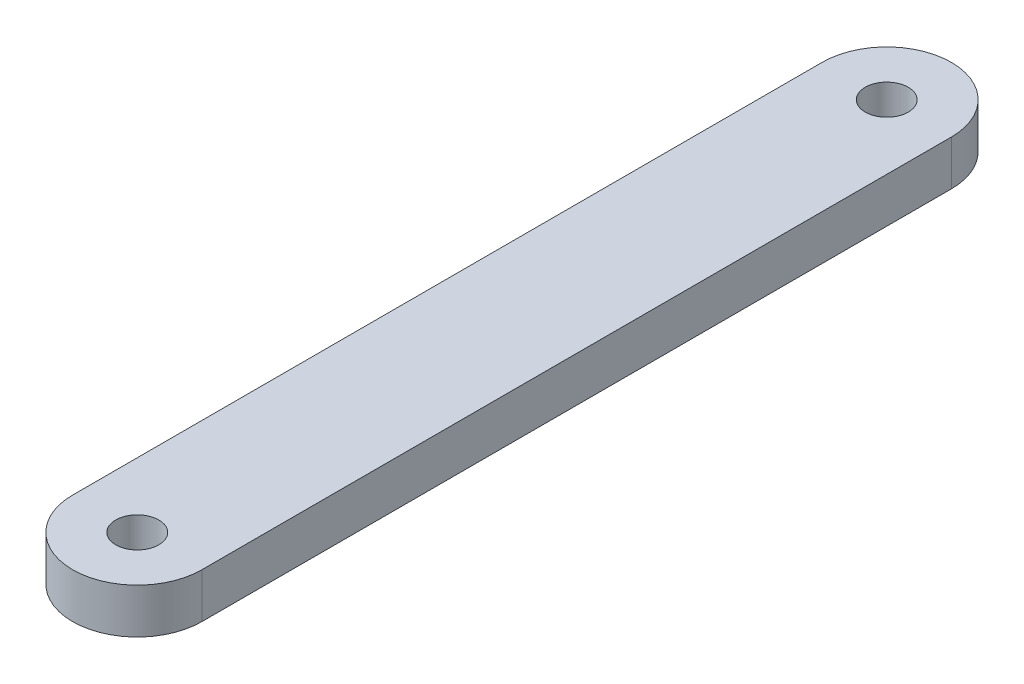
ISO-10303-21;
HEADER;
FILE_DESCRIPTION(('STEP AP214'),'2;1');
FILE_NAME('part.step','',(''),(''),'','','');
FILE_SCHEMA(('AUTOMOTIVE_DESIGN { 1 0 10303 214 1 1 1 1 }'));
ENDSEC;
DATA;
#1=APPLICATION_CONTEXT('core data for automotive mechanical design processes');
#2=APPLICATION_PROTOCOL_DEFINITION('international standard','automotive_design',2000,#1);
#3=PRODUCT_CONTEXT('',#1,'mechanical');
#4=PRODUCT('Part','Part','',(#3));
#5=PRODUCT_RELATED_PRODUCT_CATEGORY('part','',(#4));
#6=PRODUCT_DEFINITION_FORMATION('','',#4);
#7=PRODUCT_DEFINITION_CONTEXT('part definition',#1,'design');
#8=PRODUCT_DEFINITION('design','',#6,#7);
#9=PRODUCT_DEFINITION_SHAPE('','',#8);
#10=(LENGTH_UNIT() NAMED_UNIT(*) SI_UNIT(.MILLI.,.METRE.));
#11=(NAMED_UNIT(*) PLANE_ANGLE_UNIT() SI_UNIT($,.RADIAN.));
#12=(NAMED_UNIT(*) SI_UNIT($,.STERADIAN.) SOLID_ANGLE_UNIT());
#13=UNCERTAINTY_MEASURE_WITH_UNIT(LENGTH_MEASURE(1.E-05),#10,'distance_accuracy_value','');
#14=(GEOMETRIC_REPRESENTATION_CONTEXT(3) GLOBAL_UNCERTAINTY_ASSIGNED_CONTEXT((#13)) GLOBAL_UNIT_ASSIGNED_CONTEXT((#10,
#11,#12)) REPRESENTATION_CONTEXT('',''));
#15=CARTESIAN_POINT('',(0.,0.,0.));
#16=DIRECTION('',(0.,0.,1.));
#17=DIRECTION('',(1.,0.,0.));
#18=AXIS2_PLACEMENT_3D('',#15,#16,#17);
#19=CARTESIAN_POINT('',(0.,3.048,-50.8));
#20=DIRECTION('',(0.,1.,0.));
#21=DIRECTION('',(0.,0.,1.));
#22=AXIS2_PLACEMENT_3D('',#19,#20,#21);
#23=PLANE('',#22);
#24=CARTESIAN_POINT('',(0.,3.048,0.));
#25=DIRECTION('',(0.,1.,0.));
#26=DIRECTION('',(0.,0.,1.));
#27=AXIS2_PLACEMENT_3D('',#24,#25,#26);
#28=CIRCLE('',#27,1.4605);
#29=CARTESIAN_POINT('',(0.,3.048,1.4605));
#30=VERTEX_POINT('',#29);
#31=EDGE_CURVE('E99',#30,#30,#28,.T.);
#32=ORIENTED_EDGE('',*,*,#31,.F.);
#33=EDGE_LOOP('',(#32));
#34=FACE_BOUND('',#33,.T.);
#35=CARTESIAN_POINT('',(0.,3.048,-50.8));
#36=DIRECTION('',(0.,1.,0.));
#37=DIRECTION('',(0.,0.,1.));
#38=AXIS2_PLACEMENT_3D('',#35,#36,#37);
#39=CIRCLE('',#38,4.38150000000001);
#40=CARTESIAN_POINT('',(4.38150000000001,3.048,-50.8));
#41=VERTEX_POINT('',#40);
#42=CARTESIAN_POINT('',(-4.38150000000001,3.048,-50.8));
#43=VERTEX_POINT('',#42);
#44=EDGE_CURVE('E84',#41,#43,#39,.T.);
#45=ORIENTED_EDGE('',*,*,#44,.T.);
#46=DIRECTION('',(0.,0.,1.));
#47=VECTOR('',#46,1.);
#48=CARTESIAN_POINT('',(-4.38150000000001,3.048,-50.8));
#49=LINE('',#48,#47);
#50=CARTESIAN_POINT('',(-4.3815,3.048,0.));
#51=VERTEX_POINT('',#50);
#52=EDGE_CURVE('E79',#43,#51,#49,.T.);
#53=ORIENTED_EDGE('',*,*,#52,.T.);
#54=CARTESIAN_POINT('',(0.,3.048,0.));
#55=DIRECTION('',(0.,1.,0.));
#56=DIRECTION('',(0.,0.,1.));
#57=AXIS2_PLACEMENT_3D('',#54,#55,#56);
#58=CIRCLE('',#57,4.3815);
#59=CARTESIAN_POINT('',(4.3815,3.048,0.));
#60=VERTEX_POINT('',#59);
#61=EDGE_CURVE('E82',#51,#60,#58,.T.);
#62=ORIENTED_EDGE('',*,*,#61,.T.);
#63=DIRECTION('',(0.,0.,-1.));
#64=VECTOR('',#63,1.);
#65=CARTESIAN_POINT('',(4.38150000000001,3.048,-50.8));
#66=LINE('',#65,#64);
#67=EDGE_CURVE('E49',#60,#41,#66,.T.);
#68=ORIENTED_EDGE('',*,*,#67,.T.);
#69=EDGE_LOOP('',(#45,#53,#62,#68));
#70=FACE_BOUND('',#69,.T.);
#71=CARTESIAN_POINT('',(0.,3.048,-50.8));
#72=DIRECTION('',(0.,1.,0.));
#73=DIRECTION('',(0.,0.,1.));
#74=AXIS2_PLACEMENT_3D('',#71,#72,#73);
#75=CIRCLE('',#74,1.4605);
#76=CARTESIAN_POINT('',(0.,3.048,-49.3395));
#77=VERTEX_POINT('',#76);
#78=EDGE_CURVE('E114',#77,#77,#75,.T.);
#79=ORIENTED_EDGE('',*,*,#78,.F.);
#80=EDGE_LOOP('',(#79));
#81=FACE_BOUND('',#80,.T.);
#82=ADVANCED_FACE('F32',(#34,#70,#81),#23,.T.);
#83=CARTESIAN_POINT('',(0.,0.,-50.8));
#84=DIRECTION('',(0.,1.,0.));
#85=DIRECTION('',(0.,0.,1.));
#86=AXIS2_PLACEMENT_3D('',#83,#84,#85);
#87=PLANE('',#86);
#88=CARTESIAN_POINT('',(0.,0.,-50.8));
#89=DIRECTION('',(0.,1.,0.));
#90=DIRECTION('',(0.,0.,1.));
#91=AXIS2_PLACEMENT_3D('',#88,#89,#90);
#92=CIRCLE('',#91,4.38150000000001);
#93=CARTESIAN_POINT('',(4.38150000000001,0.,-50.8));
#94=VERTEX_POINT('',#93);
#95=CARTESIAN_POINT('',(-4.38150000000001,0.,-50.8));
#96=VERTEX_POINT('',#95);
#97=EDGE_CURVE('E96',#94,#96,#92,.T.);
#98=ORIENTED_EDGE('',*,*,#97,.F.);
#99=DIRECTION('',(0.,0.,-1.));
#100=VECTOR('',#99,1.);
#101=CARTESIAN_POINT('',(4.38150000000001,0.,-50.8));
#102=LINE('',#101,#100);
#103=CARTESIAN_POINT('',(4.3815,0.,0.));
#104=VERTEX_POINT('',#103);
#105=EDGE_CURVE('E72',#104,#94,#102,.T.);
#106=ORIENTED_EDGE('',*,*,#105,.F.);
#107=CARTESIAN_POINT('',(0.,0.,0.));
#108=DIRECTION('',(0.,1.,0.));
#109=DIRECTION('',(0.,0.,1.));
#110=AXIS2_PLACEMENT_3D('',#107,#108,#109);
#111=CIRCLE('',#110,4.3815);
#112=CARTESIAN_POINT('',(-4.3815,0.,0.));
#113=VERTEX_POINT('',#112);
#114=EDGE_CURVE('E66',#113,#104,#111,.T.);
#115=ORIENTED_EDGE('',*,*,#114,.F.);
#116=DIRECTION('',(0.,0.,1.));
#117=VECTOR('',#116,1.);
#118=CARTESIAN_POINT('',(-4.38150000000001,0.,-50.8));
#119=LINE('',#118,#117);
#120=EDGE_CURVE('E88',#96,#113,#119,.T.);
#121=ORIENTED_EDGE('',*,*,#120,.F.);
#122=EDGE_LOOP('',(#98,#106,#115,#121));
#123=FACE_BOUND('',#122,.T.);
#124=CARTESIAN_POINT('',(0.,0.,0.));
#125=DIRECTION('',(0.,1.,0.));
#126=DIRECTION('',(0.,0.,1.));
#127=AXIS2_PLACEMENT_3D('',#124,#125,#126);
#128=CIRCLE('',#127,1.4605);
#129=CARTESIAN_POINT('',(0.,0.,1.4605));
#130=VERTEX_POINT('',#129);
#131=EDGE_CURVE('E111',#130,#130,#128,.T.);
#132=ORIENTED_EDGE('',*,*,#131,.T.);
#133=EDGE_LOOP('',(#132));
#134=FACE_BOUND('',#133,.T.);
#135=CARTESIAN_POINT('',(0.,0.,-50.8));
#136=DIRECTION('',(0.,1.,0.));
#137=DIRECTION('',(0.,0.,1.));
#138=AXIS2_PLACEMENT_3D('',#135,#136,#137);
#139=CIRCLE('',#138,1.4605);
#140=CARTESIAN_POINT('',(0.,0.,-49.3395));
#141=VERTEX_POINT('',#140);
#142=EDGE_CURVE('E117',#141,#141,#139,.T.);
#143=ORIENTED_EDGE('',*,*,#142,.T.);
#144=EDGE_LOOP('',(#143));
#145=FACE_BOUND('',#144,.T.);
#146=ADVANCED_FACE('F107',(#123,#134,#145),#87,.F.);
#147=CARTESIAN_POINT('',(0.,3.048,-50.8));
#148=DIRECTION('',(0.,-1.,0.));
#149=DIRECTION('',(0.,0.,-1.));
#150=AXIS2_PLACEMENT_3D('',#147,#148,#149);
#151=CYLINDRICAL_SURFACE('',#150,4.38150000000001);
#152=ORIENTED_EDGE('',*,*,#97,.T.);
#153=DIRECTION('',(0.,-1.,0.));
#154=VECTOR('',#153,1.);
#155=CARTESIAN_POINT('',(-4.38150000000001,3.048,-50.8));
#156=LINE('',#155,#154);
#157=EDGE_CURVE('E11',#43,#96,#156,.T.);
#158=ORIENTED_EDGE('',*,*,#157,.F.);
#159=ORIENTED_EDGE('',*,*,#44,.F.);
#160=DIRECTION('',(0.,-1.,0.));
#161=VECTOR('',#160,1.);
#162=CARTESIAN_POINT('',(4.38150000000001,3.048,-50.8));
#163=LINE('',#162,#161);
#164=EDGE_CURVE('E92',#41,#94,#163,.T.);
#165=ORIENTED_EDGE('',*,*,#164,.T.);
#166=EDGE_LOOP('',(#152,#158,#159,#165));
#167=FACE_BOUND('',#166,.T.);
#168=ADVANCED_FACE('F34',(#167),#151,.T.);
#169=CARTESIAN_POINT('',(-4.38150000000001,3.048,-50.8));
#170=DIRECTION('',(1.,0.,0.));
#171=DIRECTION('',(0.,0.,-1.));
#172=AXIS2_PLACEMENT_3D('',#169,#170,#171);
#173=PLANE('',#172);
#174=ORIENTED_EDGE('',*,*,#120,.T.);
#175=DIRECTION('',(0.,-1.,0.));
#176=VECTOR('',#175,1.);
#177=CARTESIAN_POINT('',(-4.3815,3.048,0.));
#178=LINE('',#177,#176);
#179=EDGE_CURVE('E41',#51,#113,#178,.T.);
#180=ORIENTED_EDGE('',*,*,#179,.F.);
#181=ORIENTED_EDGE('',*,*,#52,.F.);
#182=ORIENTED_EDGE('',*,*,#157,.T.);
#183=EDGE_LOOP('',(#174,#180,#181,#182));
#184=FACE_BOUND('',#183,.T.);
#185=ADVANCED_FACE('F87',(#184),#173,.F.);
#186=CARTESIAN_POINT('',(0.,3.048,0.));
#187=DIRECTION('',(0.,-1.,0.));
#188=DIRECTION('',(0.,0.,-1.));
#189=AXIS2_PLACEMENT_3D('',#186,#187,#188);
#190=CYLINDRICAL_SURFACE('',#189,4.3815);
#191=ORIENTED_EDGE('',*,*,#114,.T.);
#192=DIRECTION('',(0.,-1.,0.));
#193=VECTOR('',#192,1.);
#194=CARTESIAN_POINT('',(4.3815,3.048,0.));
#195=LINE('',#194,#193);
#196=EDGE_CURVE('E89',#60,#104,#195,.T.);
#197=ORIENTED_EDGE('',*,*,#196,.F.);
#198=ORIENTED_EDGE('',*,*,#61,.F.);
#199=ORIENTED_EDGE('',*,*,#179,.T.);
#200=EDGE_LOOP('',(#191,#197,#198,#199));
#201=FACE_BOUND('',#200,.T.);
#202=ADVANCED_FACE('F90',(#201),#190,.T.);
#203=CARTESIAN_POINT('',(4.38150000000001,3.048,-50.8));
#204=DIRECTION('',(-1.,0.,0.));
#205=DIRECTION('',(0.,0.,1.));
#206=AXIS2_PLACEMENT_3D('',#203,#204,#205);
#207=PLANE('',#206);
#208=ORIENTED_EDGE('',*,*,#105,.T.);
#209=ORIENTED_EDGE('',*,*,#164,.F.);
#210=ORIENTED_EDGE('',*,*,#67,.F.);
#211=ORIENTED_EDGE('',*,*,#196,.T.);
#212=EDGE_LOOP('',(#208,#209,#210,#211));
#213=FACE_BOUND('',#212,.T.);
#214=ADVANCED_FACE('F104',(#213),#207,.F.);
#215=CARTESIAN_POINT('',(0.,3.048,0.));
#216=DIRECTION('',(0.,-1.,0.));
#217=DIRECTION('',(0.,0.,-1.));
#218=AXIS2_PLACEMENT_3D('',#215,#216,#217);
#219=CYLINDRICAL_SURFACE('',#218,1.4605);
#220=ORIENTED_EDGE('',*,*,#31,.T.);
#221=EDGE_LOOP('',(#220));
#222=FACE_BOUND('',#221,.T.);
#223=ORIENTED_EDGE('',*,*,#131,.F.);
#224=EDGE_LOOP('',(#223));
#225=FACE_BOUND('',#224,.T.);
#226=ADVANCED_FACE('F134',(#222,#225),#219,.F.);
#227=CARTESIAN_POINT('',(0.,3.048,-50.8));
#228=DIRECTION('',(0.,-1.,0.));
#229=DIRECTION('',(0.,0.,-1.));
#230=AXIS2_PLACEMENT_3D('',#227,#228,#229);
#231=CYLINDRICAL_SURFACE('',#230,1.4605);
#232=ORIENTED_EDGE('',*,*,#78,.T.);
#233=EDGE_LOOP('',(#232));
#234=FACE_BOUND('',#233,.T.);
#235=ORIENTED_EDGE('',*,*,#142,.F.);
#236=EDGE_LOOP('',(#235));
#237=FACE_BOUND('',#236,.T.);
#238=ADVANCED_FACE('F123',(#234,#237),#231,.F.);
#239=CLOSED_SHELL('',(#82,#146,#168,#185,#202,#214,#226,#238));
#240=MANIFOLD_SOLID_BREP('B2',#239);
#241=ADVANCED_BREP_SHAPE_REPRESENTATION('',(#18,#240),#14);
#242=SHAPE_DEFINITION_REPRESENTATION(#9,#241);
ENDSEC;
END-ISO-10303-21;
